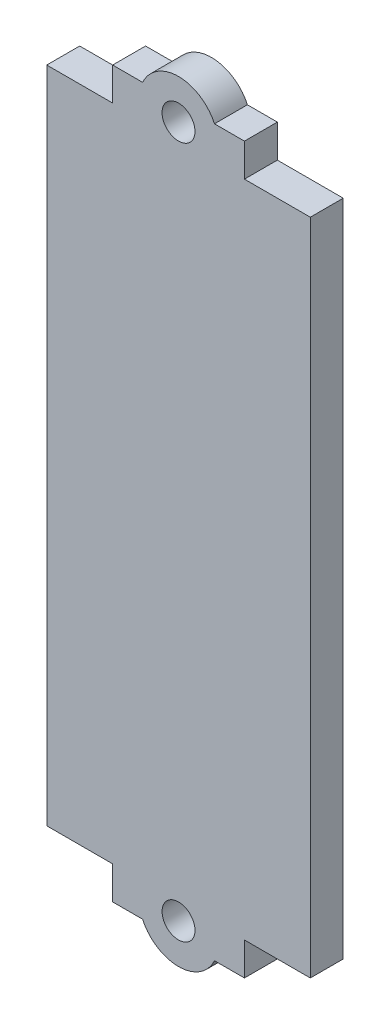
ISO-10303-21;
HEADER;
FILE_DESCRIPTION(('STEP AP214'),'2;1');
FILE_NAME('part.step','',(''),(''),'','','');
FILE_SCHEMA(('AUTOMOTIVE_DESIGN { 1 0 10303 214 1 1 1 1 }'));
ENDSEC;
DATA;
#1=APPLICATION_CONTEXT('core data for automotive mechanical design processes');
#2=APPLICATION_PROTOCOL_DEFINITION('international standard','automotive_design',2000,#1);
#3=PRODUCT_CONTEXT('',#1,'mechanical');
#4=PRODUCT('Part','Part','',(#3));
#5=PRODUCT_RELATED_PRODUCT_CATEGORY('part','',(#4));
#6=PRODUCT_DEFINITION_FORMATION('','',#4);
#7=PRODUCT_DEFINITION_CONTEXT('part definition',#1,'design');
#8=PRODUCT_DEFINITION('design','',#6,#7);
#9=PRODUCT_DEFINITION_SHAPE('','',#8);
#10=(LENGTH_UNIT() NAMED_UNIT(*) SI_UNIT(.MILLI.,.METRE.));
#11=(NAMED_UNIT(*) PLANE_ANGLE_UNIT() SI_UNIT($,.RADIAN.));
#12=(NAMED_UNIT(*) SI_UNIT($,.STERADIAN.) SOLID_ANGLE_UNIT());
#13=UNCERTAINTY_MEASURE_WITH_UNIT(LENGTH_MEASURE(1.E-05),#10,'distance_accuracy_value','');
#14=(GEOMETRIC_REPRESENTATION_CONTEXT(3) GLOBAL_UNCERTAINTY_ASSIGNED_CONTEXT((#13)) GLOBAL_UNIT_ASSIGNED_CONTEXT((#10,
#11,#12)) REPRESENTATION_CONTEXT('',''));
#15=CARTESIAN_POINT('',(0.,0.,0.));
#16=DIRECTION('',(0.,0.,1.));
#17=DIRECTION('',(1.,0.,0.));
#18=AXIS2_PLACEMENT_3D('',#15,#16,#17);
#19=CARTESIAN_POINT('',(0.,-55.,0.));
#20=DIRECTION('',(0.,1.,0.));
#21=DIRECTION('',(0.,0.,-1.));
#22=AXIS2_PLACEMENT_3D('',#19,#20,#21);
#23=PLANE('',#22);
#24=DIRECTION('',(0.,0.,1.));
#25=VECTOR('',#24,1.);
#26=CARTESIAN_POINT('',(-5.45435605731785,-55.,0.));
#27=LINE('',#26,#25);
#28=CARTESIAN_POINT('',(-5.45435605731785,-55.,5.));
#29=VERTEX_POINT('',#28);
#30=CARTESIAN_POINT('',(-5.45435605731785,-55.,0.));
#31=VERTEX_POINT('',#30);
#32=EDGE_CURVE('E11',#29,#31,#27,.F.);
#33=ORIENTED_EDGE('',*,*,#32,.F.);
#34=DIRECTION('',(1.,0.,0.));
#35=VECTOR('',#34,1.);
#36=CARTESIAN_POINT('',(-10.,-55.,5.));
#37=LINE('',#36,#35);
#38=CARTESIAN_POINT('',(-10.,-55.,5.));
#39=VERTEX_POINT('',#38);
#40=EDGE_CURVE('E156',#39,#29,#37,.T.);
#41=ORIENTED_EDGE('',*,*,#40,.F.);
#42=DIRECTION('',(0.,0.,1.));
#43=VECTOR('',#42,1.);
#44=CARTESIAN_POINT('',(-10.,-55.,5.));
#45=LINE('',#44,#43);
#46=CARTESIAN_POINT('',(-10.,-55.,0.));
#47=VERTEX_POINT('',#46);
#48=EDGE_CURVE('E177',#47,#39,#45,.T.);
#49=ORIENTED_EDGE('',*,*,#48,.F.);
#50=DIRECTION('',(-1.,0.,0.));
#51=VECTOR('',#50,1.);
#52=CARTESIAN_POINT('',(-10.,-55.,0.));
#53=LINE('',#52,#51);
#54=EDGE_CURVE('E157',#31,#47,#53,.T.);
#55=ORIENTED_EDGE('',*,*,#54,.F.);
#56=EDGE_LOOP('',(#33,#41,#49,#55));
#57=FACE_BOUND('',#56,.T.);
#58=ADVANCED_FACE('F34',(#57),#23,.F.);
#59=DIRECTION('',(0.,0.,1.));
#60=VECTOR('',#59,1.);
#61=CARTESIAN_POINT('',(5.45435605731786,-55.,0.));
#62=LINE('',#61,#60);
#63=CARTESIAN_POINT('',(5.45435605731786,-55.,0.));
#64=VERTEX_POINT('',#63);
#65=CARTESIAN_POINT('',(5.45435605731786,-55.,5.));
#66=VERTEX_POINT('',#65);
#67=EDGE_CURVE('E42',#64,#66,#62,.T.);
#68=ORIENTED_EDGE('',*,*,#67,.F.);
#69=CARTESIAN_POINT('',(10.,-55.,0.));
#70=VERTEX_POINT('',#69);
#71=EDGE_CURVE('E272',#70,#64,#53,.T.);
#72=ORIENTED_EDGE('',*,*,#71,.F.);
#73=DIRECTION('',(0.,0.,-1.));
#74=VECTOR('',#73,1.);
#75=CARTESIAN_POINT('',(9.99999999999999,-55.,5.));
#76=LINE('',#75,#74);
#77=CARTESIAN_POINT('',(9.99999999999999,-55.,5.));
#78=VERTEX_POINT('',#77);
#79=EDGE_CURVE('E167',#78,#70,#76,.T.);
#80=ORIENTED_EDGE('',*,*,#79,.F.);
#81=EDGE_CURVE('E163',#66,#78,#37,.T.);
#82=ORIENTED_EDGE('',*,*,#81,.F.);
#83=EDGE_LOOP('',(#68,#72,#80,#82));
#84=FACE_BOUND('',#83,.T.);
#85=ADVANCED_FACE('F310',(#84),#23,.F.);
#86=CARTESIAN_POINT('',(0.,55.,0.));
#87=DIRECTION('',(0.,-1.,0.));
#88=DIRECTION('',(0.,0.,-1.));
#89=AXIS2_PLACEMENT_3D('',#86,#87,#88);
#90=PLANE('',#89);
#91=DIRECTION('',(-1.,0.,0.));
#92=VECTOR('',#91,1.);
#93=CARTESIAN_POINT('',(-10.,55.,0.));
#94=LINE('',#93,#92);
#95=CARTESIAN_POINT('',(10.,55.,0.));
#96=VERTEX_POINT('',#95);
#97=CARTESIAN_POINT('',(5.45435605731786,55.,0.));
#98=VERTEX_POINT('',#97);
#99=EDGE_CURVE('E195',#96,#98,#94,.T.);
#100=ORIENTED_EDGE('',*,*,#99,.T.);
#101=DIRECTION('',(0.,0.,1.));
#102=VECTOR('',#101,1.);
#103=CARTESIAN_POINT('',(5.45435605731786,55.,0.));
#104=LINE('',#103,#102);
#105=CARTESIAN_POINT('',(5.45435605731786,55.,5.));
#106=VERTEX_POINT('',#105);
#107=EDGE_CURVE('E250',#98,#106,#104,.T.);
#108=ORIENTED_EDGE('',*,*,#107,.T.);
#109=DIRECTION('',(1.,0.,0.));
#110=VECTOR('',#109,1.);
#111=CARTESIAN_POINT('',(-10.,55.,5.));
#112=LINE('',#111,#110);
#113=CARTESIAN_POINT('',(9.99999999999999,55.,5.));
#114=VERTEX_POINT('',#113);
#115=EDGE_CURVE('E188',#106,#114,#112,.T.);
#116=ORIENTED_EDGE('',*,*,#115,.T.);
#117=DIRECTION('',(0.,0.,-1.));
#118=VECTOR('',#117,1.);
#119=CARTESIAN_POINT('',(9.99999999999999,55.,5.));
#120=LINE('',#119,#118);
#121=EDGE_CURVE('E192',#114,#96,#120,.T.);
#122=ORIENTED_EDGE('',*,*,#121,.T.);
#123=EDGE_LOOP('',(#100,#108,#116,#122));
#124=FACE_BOUND('',#123,.T.);
#125=ADVANCED_FACE('F255',(#124),#90,.F.);
#126=CARTESIAN_POINT('',(20.,-50.,5.));
#127=DIRECTION('',(0.,1.,0.));
#128=DIRECTION('',(0.,0.,1.));
#129=AXIS2_PLACEMENT_3D('',#126,#127,#128);
#130=PLANE('',#129);
#131=DIRECTION('',(1.,0.,0.));
#132=VECTOR('',#131,1.);
#133=CARTESIAN_POINT('',(20.,-50.,0.));
#134=LINE('',#133,#132);
#135=CARTESIAN_POINT('',(-20.,-50.,0.));
#136=VERTEX_POINT('',#135);
#137=CARTESIAN_POINT('',(-10.,-50.,0.));
#138=VERTEX_POINT('',#137);
#139=EDGE_CURVE('E231',#136,#138,#134,.T.);
#140=ORIENTED_EDGE('',*,*,#139,.T.);
#141=DIRECTION('',(0.,0.,1.));
#142=VECTOR('',#141,1.);
#143=CARTESIAN_POINT('',(-10.,-50.,5.));
#144=LINE('',#143,#142);
#145=CARTESIAN_POINT('',(-10.,-50.,5.));
#146=VERTEX_POINT('',#145);
#147=EDGE_CURVE('E171',#138,#146,#144,.T.);
#148=ORIENTED_EDGE('',*,*,#147,.T.);
#149=DIRECTION('',(1.,0.,0.));
#150=VECTOR('',#149,1.);
#151=CARTESIAN_POINT('',(20.,-50.,5.));
#152=LINE('',#151,#150);
#153=CARTESIAN_POINT('',(-20.,-50.,5.));
#154=VERTEX_POINT('',#153);
#155=EDGE_CURVE('E219',#154,#146,#152,.T.);
#156=ORIENTED_EDGE('',*,*,#155,.F.);
#157=DIRECTION('',(0.,0.,-1.));
#158=VECTOR('',#157,1.);
#159=CARTESIAN_POINT('',(-20.,-50.,5.));
#160=LINE('',#159,#158);
#161=EDGE_CURVE('E246',#154,#136,#160,.T.);
#162=ORIENTED_EDGE('',*,*,#161,.T.);
#163=EDGE_LOOP('',(#140,#148,#156,#162));
#164=FACE_BOUND('',#163,.T.);
#165=ADVANCED_FACE('F283',(#164),#130,.F.);
#166=CARTESIAN_POINT('',(20.,50.,5.));
#167=DIRECTION('',(0.,-1.,0.));
#168=DIRECTION('',(0.,0.,-1.));
#169=AXIS2_PLACEMENT_3D('',#166,#167,#168);
#170=PLANE('',#169);
#171=DIRECTION('',(0.,0.,1.));
#172=VECTOR('',#171,1.);
#173=CARTESIAN_POINT('',(-10.,50.,5.));
#174=LINE('',#173,#172);
#175=CARTESIAN_POINT('',(-10.,50.,0.));
#176=VERTEX_POINT('',#175);
#177=CARTESIAN_POINT('',(-10.,50.,5.));
#178=VERTEX_POINT('',#177);
#179=EDGE_CURVE('E184',#176,#178,#174,.T.);
#180=ORIENTED_EDGE('',*,*,#179,.F.);
#181=DIRECTION('',(-1.,0.,0.));
#182=VECTOR('',#181,1.);
#183=CARTESIAN_POINT('',(20.,50.,0.));
#184=LINE('',#183,#182);
#185=CARTESIAN_POINT('',(-20.,50.,0.));
#186=VERTEX_POINT('',#185);
#187=EDGE_CURVE('E236',#176,#186,#184,.T.);
#188=ORIENTED_EDGE('',*,*,#187,.T.);
#189=DIRECTION('',(0.,0.,-1.));
#190=VECTOR('',#189,1.);
#191=CARTESIAN_POINT('',(-20.,50.,5.));
#192=LINE('',#191,#190);
#193=CARTESIAN_POINT('',(-20.,50.,5.));
#194=VERTEX_POINT('',#193);
#195=EDGE_CURVE('E227',#194,#186,#192,.T.);
#196=ORIENTED_EDGE('',*,*,#195,.F.);
#197=DIRECTION('',(-1.,0.,0.));
#198=VECTOR('',#197,1.);
#199=CARTESIAN_POINT('',(20.,50.,5.));
#200=LINE('',#199,#198);
#201=EDGE_CURVE('E223',#178,#194,#200,.T.);
#202=ORIENTED_EDGE('',*,*,#201,.F.);
#203=EDGE_LOOP('',(#180,#188,#196,#202));
#204=FACE_BOUND('',#203,.T.);
#205=ADVANCED_FACE('F292',(#204),#170,.F.);
#206=DIRECTION('',(0.,0.,-1.));
#207=VECTOR('',#206,1.);
#208=CARTESIAN_POINT('',(9.99999999999999,50.,5.));
#209=LINE('',#208,#207);
#210=CARTESIAN_POINT('',(9.99999999999999,50.,5.));
#211=VERTEX_POINT('',#210);
#212=CARTESIAN_POINT('',(10.,50.,0.));
#213=VERTEX_POINT('',#212);
#214=EDGE_CURVE('E189',#211,#213,#209,.T.);
#215=ORIENTED_EDGE('',*,*,#214,.F.);
#216=CARTESIAN_POINT('',(20.,50.,5.));
#217=VERTEX_POINT('',#216);
#218=EDGE_CURVE('E224',#217,#211,#200,.T.);
#219=ORIENTED_EDGE('',*,*,#218,.F.);
#220=DIRECTION('',(0.,0.,-1.));
#221=VECTOR('',#220,1.);
#222=CARTESIAN_POINT('',(20.,50.,5.));
#223=LINE('',#222,#221);
#224=CARTESIAN_POINT('',(20.,50.,0.));
#225=VERTEX_POINT('',#224);
#226=EDGE_CURVE('E240',#217,#225,#223,.T.);
#227=ORIENTED_EDGE('',*,*,#226,.T.);
#228=EDGE_CURVE('E218',#225,#213,#184,.T.);
#229=ORIENTED_EDGE('',*,*,#228,.T.);
#230=EDGE_LOOP('',(#215,#219,#227,#229));
#231=FACE_BOUND('',#230,.T.);
#232=ADVANCED_FACE('F342',(#231),#170,.F.);
#233=CARTESIAN_POINT('',(-20.,50.,5.));
#234=DIRECTION('',(1.,0.,0.));
#235=DIRECTION('',(0.,1.,0.));
#236=AXIS2_PLACEMENT_3D('',#233,#234,#235);
#237=PLANE('',#236);
#238=DIRECTION('',(0.,-1.,0.));
#239=VECTOR('',#238,1.);
#240=CARTESIAN_POINT('',(-20.,50.,0.));
#241=LINE('',#240,#239);
#242=EDGE_CURVE('E213',#186,#136,#241,.T.);
#243=ORIENTED_EDGE('',*,*,#242,.T.);
#244=ORIENTED_EDGE('',*,*,#161,.F.);
#245=DIRECTION('',(0.,-1.,0.));
#246=VECTOR('',#245,1.);
#247=CARTESIAN_POINT('',(-20.,50.,5.));
#248=LINE('',#247,#246);
#249=EDGE_CURVE('E214',#194,#154,#248,.T.);
#250=ORIENTED_EDGE('',*,*,#249,.F.);
#251=ORIENTED_EDGE('',*,*,#195,.T.);
#252=EDGE_LOOP('',(#243,#244,#250,#251));
#253=FACE_BOUND('',#252,.T.);
#254=ADVANCED_FACE('F36',(#253),#237,.F.);
#255=CARTESIAN_POINT('',(9.99999999999999,-50.,5.));
#256=VERTEX_POINT('',#255);
#257=CARTESIAN_POINT('',(20.,-50.,5.));
#258=VERTEX_POINT('',#257);
#259=EDGE_CURVE('E217',#256,#258,#152,.T.);
#260=ORIENTED_EDGE('',*,*,#259,.F.);
#261=DIRECTION('',(0.,0.,-1.));
#262=VECTOR('',#261,1.);
#263=CARTESIAN_POINT('',(9.99999999999999,-50.,5.));
#264=LINE('',#263,#262);
#265=CARTESIAN_POINT('',(9.99999999999999,-50.,0.));
#266=VERTEX_POINT('',#265);
#267=EDGE_CURVE('E174',#256,#266,#264,.T.);
#268=ORIENTED_EDGE('',*,*,#267,.T.);
#269=CARTESIAN_POINT('',(20.,-50.,0.));
#270=VERTEX_POINT('',#269);
#271=EDGE_CURVE('E230',#266,#270,#134,.T.);
#272=ORIENTED_EDGE('',*,*,#271,.T.);
#273=DIRECTION('',(0.,0.,-1.));
#274=VECTOR('',#273,1.);
#275=CARTESIAN_POINT('',(20.,-50.,5.));
#276=LINE('',#275,#274);
#277=EDGE_CURVE('E243',#258,#270,#276,.T.);
#278=ORIENTED_EDGE('',*,*,#277,.F.);
#279=EDGE_LOOP('',(#260,#268,#272,#278));
#280=FACE_BOUND('',#279,.T.);
#281=ADVANCED_FACE('F333',(#280),#130,.F.);
#282=CARTESIAN_POINT('',(20.,50.,5.));
#283=DIRECTION('',(-1.,0.,0.));
#284=DIRECTION('',(0.,-1.,0.));
#285=AXIS2_PLACEMENT_3D('',#282,#283,#284);
#286=PLANE('',#285);
#287=DIRECTION('',(0.,1.,0.));
#288=VECTOR('',#287,1.);
#289=CARTESIAN_POINT('',(20.,50.,0.));
#290=LINE('',#289,#288);
#291=EDGE_CURVE('E234',#270,#225,#290,.T.);
#292=ORIENTED_EDGE('',*,*,#291,.T.);
#293=ORIENTED_EDGE('',*,*,#226,.F.);
#294=DIRECTION('',(0.,1.,0.));
#295=VECTOR('',#294,1.);
#296=CARTESIAN_POINT('',(20.,50.,5.));
#297=LINE('',#296,#295);
#298=EDGE_CURVE('E221',#258,#217,#297,.T.);
#299=ORIENTED_EDGE('',*,*,#298,.F.);
#300=ORIENTED_EDGE('',*,*,#277,.T.);
#301=EDGE_LOOP('',(#292,#293,#299,#300));
#302=FACE_BOUND('',#301,.T.);
#303=ADVANCED_FACE('F338',(#302),#286,.F.);
#304=CARTESIAN_POINT('',(0.,0.,5.));
#305=DIRECTION('',(0.,0.,-1.));
#306=DIRECTION('',(-1.,0.,0.));
#307=AXIS2_PLACEMENT_3D('',#304,#305,#306);
#308=PLANE('',#307);
#309=CARTESIAN_POINT('',(0.,-52.5,5.));
#310=DIRECTION('',(0.,0.,-1.));
#311=DIRECTION('',(1.,0.,0.));
#312=AXIS2_PLACEMENT_3D('',#309,#310,#311);
#313=CIRCLE('',#312,2.5);
#314=CARTESIAN_POINT('',(2.50000000000001,-52.5,5.));
#315=VERTEX_POINT('',#314);
#316=EDGE_CURVE('E508',#315,#315,#313,.T.);
#317=ORIENTED_EDGE('',*,*,#316,.T.);
#318=EDGE_LOOP('',(#317));
#319=FACE_BOUND('',#318,.T.);
#320=ORIENTED_EDGE('',*,*,#40,.T.);
#321=CARTESIAN_POINT('',(0.,-52.5,5.));
#322=DIRECTION('',(0.,0.,-1.));
#323=DIRECTION('',(1.,0.,0.));
#324=AXIS2_PLACEMENT_3D('',#321,#322,#323);
#325=CIRCLE('',#324,6.);
#326=EDGE_CURVE('E49',#66,#29,#325,.T.);
#327=ORIENTED_EDGE('',*,*,#326,.F.);
#328=ORIENTED_EDGE('',*,*,#81,.T.);
#329=DIRECTION('',(0.,1.,0.));
#330=VECTOR('',#329,1.);
#331=CARTESIAN_POINT('',(9.99999999999999,-55.,5.));
#332=LINE('',#331,#330);
#333=EDGE_CURVE('E165',#78,#256,#332,.T.);
#334=ORIENTED_EDGE('',*,*,#333,.T.);
#335=ORIENTED_EDGE('',*,*,#259,.T.);
#336=ORIENTED_EDGE('',*,*,#298,.T.);
#337=ORIENTED_EDGE('',*,*,#218,.T.);
#338=DIRECTION('',(0.,-1.,0.));
#339=VECTOR('',#338,1.);
#340=CARTESIAN_POINT('',(9.99999999999999,55.,5.));
#341=LINE('',#340,#339);
#342=EDGE_CURVE('E207',#114,#211,#341,.T.);
#343=ORIENTED_EDGE('',*,*,#342,.F.);
#344=ORIENTED_EDGE('',*,*,#115,.F.);
#345=CARTESIAN_POINT('',(0.,52.5,5.));
#346=DIRECTION('',(0.,0.,1.));
#347=DIRECTION('',(1.,0.,0.));
#348=AXIS2_PLACEMENT_3D('',#345,#346,#347);
#349=CIRCLE('',#348,6.);
#350=CARTESIAN_POINT('',(-5.45435605731785,55.,5.));
#351=VERTEX_POINT('',#350);
#352=EDGE_CURVE('E262',#106,#351,#349,.T.);
#353=ORIENTED_EDGE('',*,*,#352,.T.);
#354=CARTESIAN_POINT('',(-10.,55.,5.));
#355=VERTEX_POINT('',#354);
#356=EDGE_CURVE('E190',#355,#351,#112,.T.);
#357=ORIENTED_EDGE('',*,*,#356,.F.);
#358=DIRECTION('',(0.,-1.,0.));
#359=VECTOR('',#358,1.);
#360=CARTESIAN_POINT('',(-10.,55.,5.));
#361=LINE('',#360,#359);
#362=EDGE_CURVE('E210',#355,#178,#361,.T.);
#363=ORIENTED_EDGE('',*,*,#362,.T.);
#364=ORIENTED_EDGE('',*,*,#201,.T.);
#365=ORIENTED_EDGE('',*,*,#249,.T.);
#366=ORIENTED_EDGE('',*,*,#155,.T.);
#367=DIRECTION('',(0.,1.,0.));
#368=VECTOR('',#367,1.);
#369=CARTESIAN_POINT('',(-10.,-55.,5.));
#370=LINE('',#369,#368);
#371=EDGE_CURVE('E161',#39,#146,#370,.T.);
#372=ORIENTED_EDGE('',*,*,#371,.F.);
#373=EDGE_LOOP('',(#320,#327,#328,#334,#335,#336,#337,#343,#344,#353,#357,#363,#364,#365,#366,#372));
#374=FACE_BOUND('',#373,.T.);
#375=CARTESIAN_POINT('',(0.,52.5,5.));
#376=DIRECTION('',(0.,0.,1.));
#377=DIRECTION('',(1.,0.,0.));
#378=AXIS2_PLACEMENT_3D('',#375,#376,#377);
#379=CIRCLE('',#378,2.5);
#380=CARTESIAN_POINT('',(2.50000000000001,52.5,5.));
#381=VERTEX_POINT('',#380);
#382=EDGE_CURVE('E268',#381,#381,#379,.T.);
#383=ORIENTED_EDGE('',*,*,#382,.F.);
#384=EDGE_LOOP('',(#383));
#385=FACE_BOUND('',#384,.T.);
#386=ADVANCED_FACE('F158',(#319,#374,#385),#308,.F.);
#387=CARTESIAN_POINT('',(0.,0.,0.));
#388=DIRECTION('',(0.,0.,-1.));
#389=DIRECTION('',(-1.,0.,0.));
#390=AXIS2_PLACEMENT_3D('',#387,#388,#389);
#391=PLANE('',#390);
#392=CARTESIAN_POINT('',(0.,-52.5,0.));
#393=DIRECTION('',(0.,0.,-1.));
#394=DIRECTION('',(1.,0.,0.));
#395=AXIS2_PLACEMENT_3D('',#392,#393,#394);
#396=CIRCLE('',#395,2.5);
#397=CARTESIAN_POINT('',(2.50000000000001,-52.5,0.));
#398=VERTEX_POINT('',#397);
#399=EDGE_CURVE('E150',#398,#398,#396,.T.);
#400=ORIENTED_EDGE('',*,*,#399,.F.);
#401=EDGE_LOOP('',(#400));
#402=FACE_BOUND('',#401,.T.);
#403=CARTESIAN_POINT('',(0.,52.5,0.));
#404=DIRECTION('',(0.,0.,1.));
#405=DIRECTION('',(1.,0.,0.));
#406=AXIS2_PLACEMENT_3D('',#403,#404,#405);
#407=CIRCLE('',#406,2.5);
#408=CARTESIAN_POINT('',(2.50000000000001,52.5,0.));
#409=VERTEX_POINT('',#408);
#410=EDGE_CURVE('E264',#409,#409,#407,.T.);
#411=ORIENTED_EDGE('',*,*,#410,.T.);
#412=EDGE_LOOP('',(#411));
#413=FACE_BOUND('',#412,.T.);
#414=ORIENTED_EDGE('',*,*,#71,.T.);
#415=CARTESIAN_POINT('',(0.,-52.5,0.));
#416=DIRECTION('',(0.,0.,-1.));
#417=DIRECTION('',(1.,0.,0.));
#418=AXIS2_PLACEMENT_3D('',#415,#416,#417);
#419=CIRCLE('',#418,6.);
#420=EDGE_CURVE('E149',#64,#31,#419,.T.);
#421=ORIENTED_EDGE('',*,*,#420,.T.);
#422=ORIENTED_EDGE('',*,*,#54,.T.);
#423=DIRECTION('',(0.,1.,0.));
#424=VECTOR('',#423,1.);
#425=CARTESIAN_POINT('',(-10.,-55.,0.));
#426=LINE('',#425,#424);
#427=EDGE_CURVE('E182',#47,#138,#426,.T.);
#428=ORIENTED_EDGE('',*,*,#427,.T.);
#429=ORIENTED_EDGE('',*,*,#139,.F.);
#430=ORIENTED_EDGE('',*,*,#242,.F.);
#431=ORIENTED_EDGE('',*,*,#187,.F.);
#432=DIRECTION('',(0.,-1.,0.));
#433=VECTOR('',#432,1.);
#434=CARTESIAN_POINT('',(-10.,55.,0.));
#435=LINE('',#434,#433);
#436=CARTESIAN_POINT('',(-10.,55.,0.));
#437=VERTEX_POINT('',#436);
#438=EDGE_CURVE('E197',#437,#176,#435,.T.);
#439=ORIENTED_EDGE('',*,*,#438,.F.);
#440=CARTESIAN_POINT('',(-5.45435605731785,55.,0.));
#441=VERTEX_POINT('',#440);
#442=EDGE_CURVE('E194',#441,#437,#94,.T.);
#443=ORIENTED_EDGE('',*,*,#442,.F.);
#444=CARTESIAN_POINT('',(0.,52.5,0.));
#445=DIRECTION('',(0.,0.,1.));
#446=DIRECTION('',(1.,0.,0.));
#447=AXIS2_PLACEMENT_3D('',#444,#445,#446);
#448=CIRCLE('',#447,6.);
#449=EDGE_CURVE('E175',#98,#441,#448,.T.);
#450=ORIENTED_EDGE('',*,*,#449,.F.);
#451=ORIENTED_EDGE('',*,*,#99,.F.);
#452=DIRECTION('',(0.,-1.,0.));
#453=VECTOR('',#452,1.);
#454=CARTESIAN_POINT('',(10.,55.,0.));
#455=LINE('',#454,#453);
#456=EDGE_CURVE('E204',#96,#213,#455,.T.);
#457=ORIENTED_EDGE('',*,*,#456,.T.);
#458=ORIENTED_EDGE('',*,*,#228,.F.);
#459=ORIENTED_EDGE('',*,*,#291,.F.);
#460=ORIENTED_EDGE('',*,*,#271,.F.);
#461=DIRECTION('',(0.,1.,0.));
#462=VECTOR('',#461,1.);
#463=CARTESIAN_POINT('',(10.,-55.,0.));
#464=LINE('',#463,#462);
#465=EDGE_CURVE('E180',#70,#266,#464,.T.);
#466=ORIENTED_EDGE('',*,*,#465,.F.);
#467=EDGE_LOOP('',(#414,#421,#422,#428,#429,#430,#431,#439,#443,#450,#451,#457,#458,#459,#460,#466));
#468=FACE_BOUND('',#467,.T.);
#469=ADVANCED_FACE('F278',(#402,#413,#468),#391,.T.);
#470=CARTESIAN_POINT('',(-10.,55.,5.));
#471=DIRECTION('',(1.,0.,0.));
#472=DIRECTION('',(0.,0.,-1.));
#473=AXIS2_PLACEMENT_3D('',#470,#471,#472);
#474=PLANE('',#473);
#475=ORIENTED_EDGE('',*,*,#179,.T.);
#476=ORIENTED_EDGE('',*,*,#362,.F.);
#477=DIRECTION('',(0.,0.,1.));
#478=VECTOR('',#477,1.);
#479=CARTESIAN_POINT('',(-10.,55.,5.));
#480=LINE('',#479,#478);
#481=EDGE_CURVE('E185',#437,#355,#480,.T.);
#482=ORIENTED_EDGE('',*,*,#481,.F.);
#483=ORIENTED_EDGE('',*,*,#438,.T.);
#484=EDGE_LOOP('',(#475,#476,#482,#483));
#485=FACE_BOUND('',#484,.T.);
#486=ADVANCED_FACE('F295',(#485),#474,.F.);
#487=CARTESIAN_POINT('',(9.99999999999999,55.,5.));
#488=DIRECTION('',(-1.,0.,0.));
#489=DIRECTION('',(0.,0.,1.));
#490=AXIS2_PLACEMENT_3D('',#487,#488,#489);
#491=PLANE('',#490);
#492=ORIENTED_EDGE('',*,*,#214,.T.);
#493=ORIENTED_EDGE('',*,*,#456,.F.);
#494=ORIENTED_EDGE('',*,*,#121,.F.);
#495=ORIENTED_EDGE('',*,*,#342,.T.);
#496=EDGE_LOOP('',(#492,#493,#494,#495));
#497=FACE_BOUND('',#496,.T.);
#498=ADVANCED_FACE('F299',(#497),#491,.F.);
#499=ORIENTED_EDGE('',*,*,#356,.T.);
#500=DIRECTION('',(0.,0.,1.));
#501=VECTOR('',#500,1.);
#502=CARTESIAN_POINT('',(-5.45435605731785,55.,0.));
#503=LINE('',#502,#501);
#504=EDGE_CURVE('E57',#351,#441,#503,.F.);
#505=ORIENTED_EDGE('',*,*,#504,.T.);
#506=ORIENTED_EDGE('',*,*,#442,.T.);
#507=ORIENTED_EDGE('',*,*,#481,.T.);
#508=EDGE_LOOP('',(#499,#505,#506,#507));
#509=FACE_BOUND('',#508,.T.);
#510=ADVANCED_FACE('F297',(#509),#90,.F.);
#511=CARTESIAN_POINT('',(-10.,-55.,5.));
#512=DIRECTION('',(-1.,0.,0.));
#513=DIRECTION('',(0.,0.,1.));
#514=AXIS2_PLACEMENT_3D('',#511,#512,#513);
#515=PLANE('',#514);
#516=ORIENTED_EDGE('',*,*,#147,.F.);
#517=ORIENTED_EDGE('',*,*,#427,.F.);
#518=ORIENTED_EDGE('',*,*,#48,.T.);
#519=ORIENTED_EDGE('',*,*,#371,.T.);
#520=EDGE_LOOP('',(#516,#517,#518,#519));
#521=FACE_BOUND('',#520,.T.);
#522=ADVANCED_FACE('F281',(#521),#515,.T.);
#523=CARTESIAN_POINT('',(9.99999999999999,-55.,5.));
#524=DIRECTION('',(1.,0.,0.));
#525=DIRECTION('',(0.,0.,-1.));
#526=AXIS2_PLACEMENT_3D('',#523,#524,#525);
#527=PLANE('',#526);
#528=ORIENTED_EDGE('',*,*,#267,.F.);
#529=ORIENTED_EDGE('',*,*,#333,.F.);
#530=ORIENTED_EDGE('',*,*,#79,.T.);
#531=ORIENTED_EDGE('',*,*,#465,.T.);
#532=EDGE_LOOP('',(#528,#529,#530,#531));
#533=FACE_BOUND('',#532,.T.);
#534=ADVANCED_FACE('F305',(#533),#527,.T.);
#535=CARTESIAN_POINT('',(0.,52.5,0.));
#536=DIRECTION('',(0.,0.,1.));
#537=DIRECTION('',(1.,0.,0.));
#538=AXIS2_PLACEMENT_3D('',#535,#536,#537);
#539=CYLINDRICAL_SURFACE('',#538,6.);
#540=ORIENTED_EDGE('',*,*,#107,.F.);
#541=ORIENTED_EDGE('',*,*,#449,.T.);
#542=ORIENTED_EDGE('',*,*,#504,.F.);
#543=ORIENTED_EDGE('',*,*,#352,.F.);
#544=EDGE_LOOP('',(#540,#541,#542,#543));
#545=FACE_BOUND('',#544,.T.);
#546=ADVANCED_FACE('F263',(#545),#539,.T.);
#547=CARTESIAN_POINT('',(0.,52.5,0.));
#548=DIRECTION('',(0.,0.,1.));
#549=DIRECTION('',(1.,0.,0.));
#550=AXIS2_PLACEMENT_3D('',#547,#548,#549);
#551=CYLINDRICAL_SURFACE('',#550,2.5);
#552=ORIENTED_EDGE('',*,*,#410,.F.);
#553=EDGE_LOOP('',(#552));
#554=FACE_BOUND('',#553,.T.);
#555=ORIENTED_EDGE('',*,*,#382,.T.);
#556=EDGE_LOOP('',(#555));
#557=FACE_BOUND('',#556,.T.);
#558=ADVANCED_FACE('F325',(#554,#557),#551,.F.);
#559=CARTESIAN_POINT('',(0.,-52.5,0.));
#560=DIRECTION('',(0.,0.,1.));
#561=DIRECTION('',(1.,0.,0.));
#562=AXIS2_PLACEMENT_3D('',#559,#560,#561);
#563=CYLINDRICAL_SURFACE('',#562,6.);
#564=ORIENTED_EDGE('',*,*,#326,.T.);
#565=ORIENTED_EDGE('',*,*,#32,.T.);
#566=ORIENTED_EDGE('',*,*,#420,.F.);
#567=ORIENTED_EDGE('',*,*,#67,.T.);
#568=EDGE_LOOP('',(#564,#565,#566,#567));
#569=FACE_BOUND('',#568,.T.);
#570=ADVANCED_FACE('F145',(#569),#563,.T.);
#571=CARTESIAN_POINT('',(0.,-52.5,0.));
#572=DIRECTION('',(0.,0.,1.));
#573=DIRECTION('',(1.,0.,0.));
#574=AXIS2_PLACEMENT_3D('',#571,#572,#573);
#575=CYLINDRICAL_SURFACE('',#574,2.5);
#576=ORIENTED_EDGE('',*,*,#399,.T.);
#577=EDGE_LOOP('',(#576));
#578=FACE_BOUND('',#577,.T.);
#579=ORIENTED_EDGE('',*,*,#316,.F.);
#580=EDGE_LOOP('',(#579));
#581=FACE_BOUND('',#580,.T.);
#582=ADVANCED_FACE('F490',(#578,#581),#575,.F.);
#583=CLOSED_SHELL('',(#58,#85,#125,#165,#205,#232,#254,#281,#303,#386,#469,#486,#498,#510,#522,
#534,#546,#558,#570,#582));
#584=MANIFOLD_SOLID_BREP('B2',#583);
#585=ADVANCED_BREP_SHAPE_REPRESENTATION('',(#18,#584),#14);
#586=SHAPE_DEFINITION_REPRESENTATION(#9,#585);
ENDSEC;
END-ISO-10303-21;
